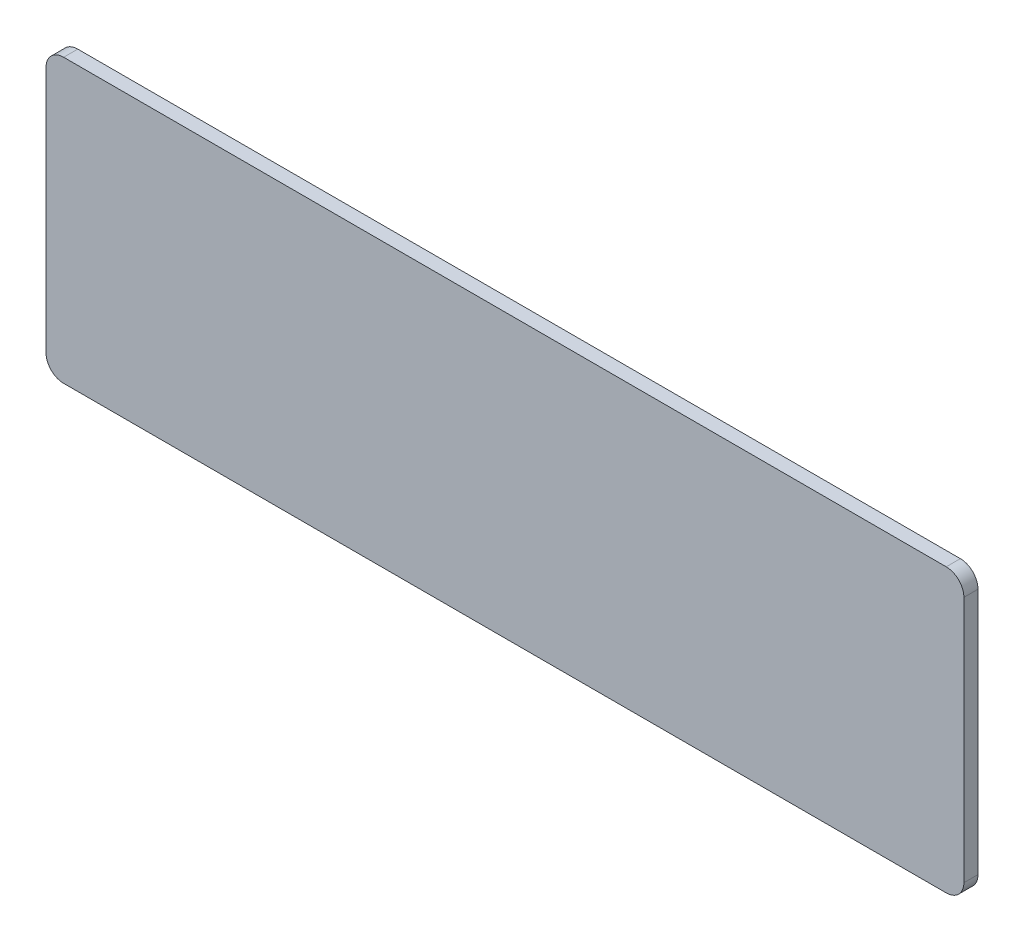
ISO-10303-21;
HEADER;
FILE_DESCRIPTION(('STEP AP214'),'2;1');
FILE_NAME('part.step','',(''),(''),'','','');
FILE_SCHEMA(('AUTOMOTIVE_DESIGN { 1 0 10303 214 1 1 1 1 }'));
ENDSEC;
DATA;
#1=APPLICATION_CONTEXT('core data for automotive mechanical design processes');
#2=APPLICATION_PROTOCOL_DEFINITION('international standard','automotive_design',2000,#1);
#3=PRODUCT_CONTEXT('',#1,'mechanical');
#4=PRODUCT('Part','Part','',(#3));
#5=PRODUCT_RELATED_PRODUCT_CATEGORY('part','',(#4));
#6=PRODUCT_DEFINITION_FORMATION('','',#4);
#7=PRODUCT_DEFINITION_CONTEXT('part definition',#1,'design');
#8=PRODUCT_DEFINITION('design','',#6,#7);
#9=PRODUCT_DEFINITION_SHAPE('','',#8);
#10=(LENGTH_UNIT() NAMED_UNIT(*) SI_UNIT(.MILLI.,.METRE.));
#11=(NAMED_UNIT(*) PLANE_ANGLE_UNIT() SI_UNIT($,.RADIAN.));
#12=(NAMED_UNIT(*) SI_UNIT($,.STERADIAN.) SOLID_ANGLE_UNIT());
#13=UNCERTAINTY_MEASURE_WITH_UNIT(LENGTH_MEASURE(1.E-05),#10,'distance_accuracy_value','');
#14=(GEOMETRIC_REPRESENTATION_CONTEXT(3) GLOBAL_UNCERTAINTY_ASSIGNED_CONTEXT((#13)) GLOBAL_UNIT_ASSIGNED_CONTEXT((#10,
#11,#12)) REPRESENTATION_CONTEXT('',''));
#15=CARTESIAN_POINT('',(0.,0.,0.));
#16=DIRECTION('',(0.,0.,1.));
#17=DIRECTION('',(1.,0.,0.));
#18=AXIS2_PLACEMENT_3D('',#15,#16,#17);
#19=CARTESIAN_POINT('',(-130.,-40.,-4.));
#20=DIRECTION('',(-1.,0.,0.));
#21=DIRECTION('',(0.,0.,1.));
#22=AXIS2_PLACEMENT_3D('',#19,#20,#21);
#23=PLANE('',#22);
#24=DIRECTION('',(0.,-1.,0.));
#25=VECTOR('',#24,1.);
#26=CARTESIAN_POINT('',(-130.,-40.,-4.));
#27=LINE('',#26,#25);
#28=CARTESIAN_POINT('',(-130.,35.,-4.));
#29=VERTEX_POINT('',#28);
#30=CARTESIAN_POINT('',(-130.,-35.,-4.));
#31=VERTEX_POINT('',#30);
#32=EDGE_CURVE('E158',#29,#31,#27,.T.);
#33=ORIENTED_EDGE('',*,*,#32,.T.);
#34=DIRECTION('',(0.,0.,1.));
#35=VECTOR('',#34,1.);
#36=CARTESIAN_POINT('',(-130.,-35.,-4.));
#37=LINE('',#36,#35);
#38=CARTESIAN_POINT('',(-130.,-35.,0.));
#39=VERTEX_POINT('',#38);
#40=EDGE_CURVE('E11',#31,#39,#37,.T.);
#41=ORIENTED_EDGE('',*,*,#40,.T.);
#42=DIRECTION('',(0.,-1.,0.));
#43=VECTOR('',#42,1.);
#44=CARTESIAN_POINT('',(-130.,-40.,0.));
#45=LINE('',#44,#43);
#46=CARTESIAN_POINT('',(-130.,35.,0.));
#47=VERTEX_POINT('',#46);
#48=EDGE_CURVE('E108',#47,#39,#45,.T.);
#49=ORIENTED_EDGE('',*,*,#48,.F.);
#50=DIRECTION('',(0.,0.,1.));
#51=VECTOR('',#50,1.);
#52=CARTESIAN_POINT('',(-130.,35.,-4.));
#53=LINE('',#52,#51);
#54=EDGE_CURVE('E44',#47,#29,#53,.F.);
#55=ORIENTED_EDGE('',*,*,#54,.T.);
#56=EDGE_LOOP('',(#33,#41,#49,#55));
#57=FACE_BOUND('',#56,.T.);
#58=ADVANCED_FACE('F36',(#57),#23,.T.);
#59=CARTESIAN_POINT('',(130.,40.,-4.));
#60=DIRECTION('',(0.,1.,0.));
#61=DIRECTION('',(-1.,0.,0.));
#62=AXIS2_PLACEMENT_3D('',#59,#60,#61);
#63=PLANE('',#62);
#64=DIRECTION('',(-1.,0.,0.));
#65=VECTOR('',#64,1.);
#66=CARTESIAN_POINT('',(130.,40.,0.));
#67=LINE('',#66,#65);
#68=CARTESIAN_POINT('',(125.,40.,0.));
#69=VERTEX_POINT('',#68);
#70=CARTESIAN_POINT('',(-125.,40.,0.));
#71=VERTEX_POINT('',#70);
#72=EDGE_CURVE('E134',#69,#71,#67,.T.);
#73=ORIENTED_EDGE('',*,*,#72,.F.);
#74=DIRECTION('',(0.,0.,1.));
#75=VECTOR('',#74,1.);
#76=CARTESIAN_POINT('',(125.,40.,-4.));
#77=LINE('',#76,#75);
#78=CARTESIAN_POINT('',(125.,40.,-4.));
#79=VERTEX_POINT('',#78);
#80=EDGE_CURVE('E58',#69,#79,#77,.F.);
#81=ORIENTED_EDGE('',*,*,#80,.T.);
#82=DIRECTION('',(-1.,0.,0.));
#83=VECTOR('',#82,1.);
#84=CARTESIAN_POINT('',(130.,40.,-4.));
#85=LINE('',#84,#83);
#86=CARTESIAN_POINT('',(-125.,40.,-4.));
#87=VERTEX_POINT('',#86);
#88=EDGE_CURVE('E128',#79,#87,#85,.T.);
#89=ORIENTED_EDGE('',*,*,#88,.T.);
#90=DIRECTION('',(0.,0.,1.));
#91=VECTOR('',#90,1.);
#92=CARTESIAN_POINT('',(-125.,40.,-4.));
#93=LINE('',#92,#91);
#94=EDGE_CURVE('E152',#87,#71,#93,.T.);
#95=ORIENTED_EDGE('',*,*,#94,.T.);
#96=EDGE_LOOP('',(#73,#81,#89,#95));
#97=FACE_BOUND('',#96,.T.);
#98=ADVANCED_FACE('F166',(#97),#63,.T.);
#99=CARTESIAN_POINT('',(130.,-40.,-4.));
#100=DIRECTION('',(1.,0.,0.));
#101=DIRECTION('',(0.,0.,-1.));
#102=AXIS2_PLACEMENT_3D('',#99,#100,#101);
#103=PLANE('',#102);
#104=DIRECTION('',(0.,1.,0.));
#105=VECTOR('',#104,1.);
#106=CARTESIAN_POINT('',(130.,-40.,0.));
#107=LINE('',#106,#105);
#108=CARTESIAN_POINT('',(130.,-35.,0.));
#109=VERTEX_POINT('',#108);
#110=CARTESIAN_POINT('',(130.,35.,0.));
#111=VERTEX_POINT('',#110);
#112=EDGE_CURVE('E123',#109,#111,#107,.T.);
#113=ORIENTED_EDGE('',*,*,#112,.F.);
#114=DIRECTION('',(0.,0.,1.));
#115=VECTOR('',#114,1.);
#116=CARTESIAN_POINT('',(130.,-35.,-4.));
#117=LINE('',#116,#115);
#118=CARTESIAN_POINT('',(130.,-35.,-4.));
#119=VERTEX_POINT('',#118);
#120=EDGE_CURVE('E144',#109,#119,#117,.F.);
#121=ORIENTED_EDGE('',*,*,#120,.T.);
#122=DIRECTION('',(0.,1.,0.));
#123=VECTOR('',#122,1.);
#124=CARTESIAN_POINT('',(130.,-40.,-4.));
#125=LINE('',#124,#123);
#126=CARTESIAN_POINT('',(130.,35.,-4.));
#127=VERTEX_POINT('',#126);
#128=EDGE_CURVE('E131',#119,#127,#125,.T.);
#129=ORIENTED_EDGE('',*,*,#128,.T.);
#130=DIRECTION('',(0.,0.,1.));
#131=VECTOR('',#130,1.);
#132=CARTESIAN_POINT('',(130.,35.,-4.));
#133=LINE('',#132,#131);
#134=EDGE_CURVE('E141',#127,#111,#133,.T.);
#135=ORIENTED_EDGE('',*,*,#134,.T.);
#136=EDGE_LOOP('',(#113,#121,#129,#135));
#137=FACE_BOUND('',#136,.T.);
#138=ADVANCED_FACE('F178',(#137),#103,.T.);
#139=CARTESIAN_POINT('',(130.,-40.,-4.));
#140=DIRECTION('',(0.,-1.,0.));
#141=DIRECTION('',(1.,0.,0.));
#142=AXIS2_PLACEMENT_3D('',#139,#140,#141);
#143=PLANE('',#142);
#144=DIRECTION('',(1.,0.,0.));
#145=VECTOR('',#144,1.);
#146=CARTESIAN_POINT('',(130.,-40.,-4.));
#147=LINE('',#146,#145);
#148=CARTESIAN_POINT('',(-125.,-40.,-4.));
#149=VERTEX_POINT('',#148);
#150=CARTESIAN_POINT('',(125.,-40.,-4.));
#151=VERTEX_POINT('',#150);
#152=EDGE_CURVE('E162',#149,#151,#147,.T.);
#153=ORIENTED_EDGE('',*,*,#152,.T.);
#154=DIRECTION('',(0.,0.,1.));
#155=VECTOR('',#154,1.);
#156=CARTESIAN_POINT('',(125.,-40.,-4.));
#157=LINE('',#156,#155);
#158=CARTESIAN_POINT('',(125.,-40.,0.));
#159=VERTEX_POINT('',#158);
#160=EDGE_CURVE('E122',#151,#159,#157,.T.);
#161=ORIENTED_EDGE('',*,*,#160,.T.);
#162=DIRECTION('',(1.,0.,0.));
#163=VECTOR('',#162,1.);
#164=CARTESIAN_POINT('',(130.,-40.,0.));
#165=LINE('',#164,#163);
#166=CARTESIAN_POINT('',(-125.,-40.,0.));
#167=VERTEX_POINT('',#166);
#168=EDGE_CURVE('E106',#167,#159,#165,.T.);
#169=ORIENTED_EDGE('',*,*,#168,.F.);
#170=DIRECTION('',(0.,0.,1.));
#171=VECTOR('',#170,1.);
#172=CARTESIAN_POINT('',(-125.,-40.,-4.));
#173=LINE('',#172,#171);
#174=EDGE_CURVE('E119',#167,#149,#173,.F.);
#175=ORIENTED_EDGE('',*,*,#174,.T.);
#176=EDGE_LOOP('',(#153,#161,#169,#175));
#177=FACE_BOUND('',#176,.T.);
#178=ADVANCED_FACE('F118',(#177),#143,.T.);
#179=CARTESIAN_POINT('',(0.,0.,-4.));
#180=DIRECTION('',(0.,0.,1.));
#181=DIRECTION('',(1.,0.,0.));
#182=AXIS2_PLACEMENT_3D('',#179,#180,#181);
#183=PLANE('',#182);
#184=ORIENTED_EDGE('',*,*,#128,.F.);
#185=CARTESIAN_POINT('',(125.,-35.,-4.));
#186=DIRECTION('',(0.,0.,1.));
#187=DIRECTION('',(1.,0.,0.));
#188=AXIS2_PLACEMENT_3D('',#185,#186,#187);
#189=CIRCLE('',#188,5.);
#190=EDGE_CURVE('E150',#119,#151,#189,.F.);
#191=ORIENTED_EDGE('',*,*,#190,.T.);
#192=ORIENTED_EDGE('',*,*,#152,.F.);
#193=CARTESIAN_POINT('',(-125.,-35.,-4.));
#194=DIRECTION('',(0.,0.,1.));
#195=DIRECTION('',(1.,0.,0.));
#196=AXIS2_PLACEMENT_3D('',#193,#194,#195);
#197=CIRCLE('',#196,5.);
#198=EDGE_CURVE('E127',#149,#31,#197,.F.);
#199=ORIENTED_EDGE('',*,*,#198,.T.);
#200=ORIENTED_EDGE('',*,*,#32,.F.);
#201=CARTESIAN_POINT('',(-125.,35.,-4.));
#202=DIRECTION('',(0.,0.,1.));
#203=DIRECTION('',(1.,0.,0.));
#204=AXIS2_PLACEMENT_3D('',#201,#202,#203);
#205=CIRCLE('',#204,5.);
#206=EDGE_CURVE('E51',#29,#87,#205,.F.);
#207=ORIENTED_EDGE('',*,*,#206,.T.);
#208=ORIENTED_EDGE('',*,*,#88,.F.);
#209=CARTESIAN_POINT('',(125.,35.,-4.));
#210=DIRECTION('',(0.,0.,1.));
#211=DIRECTION('',(1.,0.,0.));
#212=AXIS2_PLACEMENT_3D('',#209,#210,#211);
#213=CIRCLE('',#212,5.);
#214=EDGE_CURVE('E148',#79,#127,#213,.F.);
#215=ORIENTED_EDGE('',*,*,#214,.T.);
#216=EDGE_LOOP('',(#184,#191,#192,#199,#200,#207,#208,#215));
#217=FACE_BOUND('',#216,.T.);
#218=ADVANCED_FACE('F161',(#217),#183,.F.);
#219=CARTESIAN_POINT('',(0.,0.,0.));
#220=DIRECTION('',(0.,0.,1.));
#221=DIRECTION('',(1.,0.,0.));
#222=AXIS2_PLACEMENT_3D('',#219,#220,#221);
#223=PLANE('',#222);
#224=ORIENTED_EDGE('',*,*,#168,.T.);
#225=CARTESIAN_POINT('',(125.,-35.,0.));
#226=DIRECTION('',(0.,0.,1.));
#227=DIRECTION('',(1.,0.,0.));
#228=AXIS2_PLACEMENT_3D('',#225,#226,#227);
#229=CIRCLE('',#228,5.);
#230=EDGE_CURVE('E139',#159,#109,#229,.T.);
#231=ORIENTED_EDGE('',*,*,#230,.T.);
#232=ORIENTED_EDGE('',*,*,#112,.T.);
#233=CARTESIAN_POINT('',(125.,35.,0.));
#234=DIRECTION('',(0.,0.,1.));
#235=DIRECTION('',(1.,0.,0.));
#236=AXIS2_PLACEMENT_3D('',#233,#234,#235);
#237=CIRCLE('',#236,5.);
#238=EDGE_CURVE('E112',#111,#69,#237,.T.);
#239=ORIENTED_EDGE('',*,*,#238,.T.);
#240=ORIENTED_EDGE('',*,*,#72,.T.);
#241=CARTESIAN_POINT('',(-125.,35.,0.));
#242=DIRECTION('',(0.,0.,1.));
#243=DIRECTION('',(1.,0.,0.));
#244=AXIS2_PLACEMENT_3D('',#241,#242,#243);
#245=CIRCLE('',#244,5.);
#246=EDGE_CURVE('E113',#71,#47,#245,.T.);
#247=ORIENTED_EDGE('',*,*,#246,.T.);
#248=ORIENTED_EDGE('',*,*,#48,.T.);
#249=CARTESIAN_POINT('',(-125.,-35.,0.));
#250=DIRECTION('',(0.,0.,1.));
#251=DIRECTION('',(1.,0.,0.));
#252=AXIS2_PLACEMENT_3D('',#249,#250,#251);
#253=CIRCLE('',#252,5.);
#254=EDGE_CURVE('E103',#39,#167,#253,.T.);
#255=ORIENTED_EDGE('',*,*,#254,.T.);
#256=EDGE_LOOP('',(#224,#231,#232,#239,#240,#247,#248,#255));
#257=FACE_BOUND('',#256,.T.);
#258=ADVANCED_FACE('F105',(#257),#223,.T.);
#259=CARTESIAN_POINT('',(125.,-35.,-4.));
#260=DIRECTION('',(0.,0.,1.));
#261=DIRECTION('',(1.,0.,0.));
#262=AXIS2_PLACEMENT_3D('',#259,#260,#261);
#263=CYLINDRICAL_SURFACE('',#262,5.);
#264=ORIENTED_EDGE('',*,*,#190,.F.);
#265=ORIENTED_EDGE('',*,*,#120,.F.);
#266=ORIENTED_EDGE('',*,*,#230,.F.);
#267=ORIENTED_EDGE('',*,*,#160,.F.);
#268=EDGE_LOOP('',(#264,#265,#266,#267));
#269=FACE_BOUND('',#268,.T.);
#270=ADVANCED_FACE('F175',(#269),#263,.T.);
#271=CARTESIAN_POINT('',(125.,35.,-4.));
#272=DIRECTION('',(0.,0.,1.));
#273=DIRECTION('',(1.,0.,0.));
#274=AXIS2_PLACEMENT_3D('',#271,#272,#273);
#275=CYLINDRICAL_SURFACE('',#274,5.);
#276=ORIENTED_EDGE('',*,*,#214,.F.);
#277=ORIENTED_EDGE('',*,*,#80,.F.);
#278=ORIENTED_EDGE('',*,*,#238,.F.);
#279=ORIENTED_EDGE('',*,*,#134,.F.);
#280=EDGE_LOOP('',(#276,#277,#278,#279));
#281=FACE_BOUND('',#280,.T.);
#282=ADVANCED_FACE('F182',(#281),#275,.T.);
#283=CARTESIAN_POINT('',(-125.,-35.,-4.));
#284=DIRECTION('',(0.,0.,1.));
#285=DIRECTION('',(1.,0.,0.));
#286=AXIS2_PLACEMENT_3D('',#283,#284,#285);
#287=CYLINDRICAL_SURFACE('',#286,5.);
#288=ORIENTED_EDGE('',*,*,#198,.F.);
#289=ORIENTED_EDGE('',*,*,#174,.F.);
#290=ORIENTED_EDGE('',*,*,#254,.F.);
#291=ORIENTED_EDGE('',*,*,#40,.F.);
#292=EDGE_LOOP('',(#288,#289,#290,#291));
#293=FACE_BOUND('',#292,.T.);
#294=ADVANCED_FACE('F126',(#293),#287,.T.);
#295=CARTESIAN_POINT('',(-125.,35.,-4.));
#296=DIRECTION('',(0.,0.,1.));
#297=DIRECTION('',(1.,0.,0.));
#298=AXIS2_PLACEMENT_3D('',#295,#296,#297);
#299=CYLINDRICAL_SURFACE('',#298,5.);
#300=ORIENTED_EDGE('',*,*,#206,.F.);
#301=ORIENTED_EDGE('',*,*,#54,.F.);
#302=ORIENTED_EDGE('',*,*,#246,.F.);
#303=ORIENTED_EDGE('',*,*,#94,.F.);
#304=EDGE_LOOP('',(#300,#301,#302,#303));
#305=FACE_BOUND('',#304,.T.);
#306=ADVANCED_FACE('F38',(#305),#299,.T.);
#307=CLOSED_SHELL('',(#58,#98,#138,#178,#218,#258,#270,#282,#294,#306));
#308=MANIFOLD_SOLID_BREP('B2',#307);
#309=ADVANCED_BREP_SHAPE_REPRESENTATION('',(#18,#308),#14);
#310=SHAPE_DEFINITION_REPRESENTATION(#9,#309);
ENDSEC;
END-ISO-10303-21;
